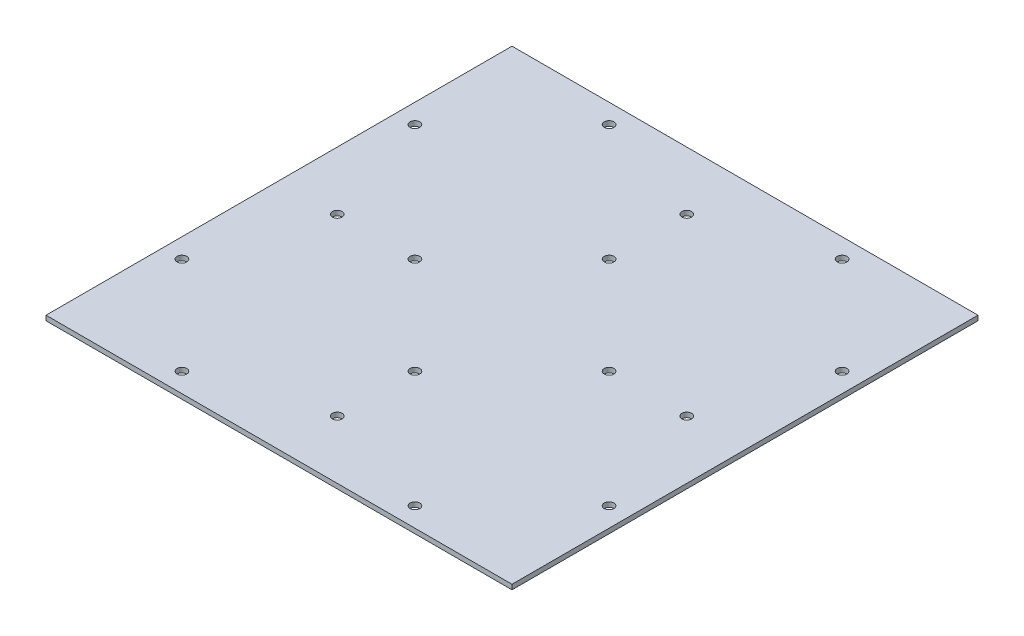
ISO-10303-21;
HEADER;
FILE_DESCRIPTION(('STEP AP214'),'2;1');
FILE_NAME('part.step','',(''),(''),'','','');
FILE_SCHEMA(('AUTOMOTIVE_DESIGN { 1 0 10303 214 1 1 1 1 }'));
ENDSEC;
DATA;
#1=APPLICATION_CONTEXT('core data for automotive mechanical design processes');
#2=APPLICATION_PROTOCOL_DEFINITION('international standard','automotive_design',2000,#1);
#3=PRODUCT_CONTEXT('',#1,'mechanical');
#4=PRODUCT('Part','Part','',(#3));
#5=PRODUCT_RELATED_PRODUCT_CATEGORY('part','',(#4));
#6=PRODUCT_DEFINITION_FORMATION('','',#4);
#7=PRODUCT_DEFINITION_CONTEXT('part definition',#1,'design');
#8=PRODUCT_DEFINITION('design','',#6,#7);
#9=PRODUCT_DEFINITION_SHAPE('','',#8);
#10=(LENGTH_UNIT() NAMED_UNIT(*) SI_UNIT(.MILLI.,.METRE.));
#11=(NAMED_UNIT(*) PLANE_ANGLE_UNIT() SI_UNIT($,.RADIAN.));
#12=(NAMED_UNIT(*) SI_UNIT($,.STERADIAN.) SOLID_ANGLE_UNIT());
#13=UNCERTAINTY_MEASURE_WITH_UNIT(LENGTH_MEASURE(1.E-05),#10,'distance_accuracy_value','');
#14=(GEOMETRIC_REPRESENTATION_CONTEXT(3) GLOBAL_UNCERTAINTY_ASSIGNED_CONTEXT((#13)) GLOBAL_UNIT_ASSIGNED_CONTEXT((#10,
#11,#12)) REPRESENTATION_CONTEXT('',''));
#15=CARTESIAN_POINT('',(0.,0.,0.));
#16=DIRECTION('',(0.,0.,1.));
#17=DIRECTION('',(1.,0.,0.));
#18=AXIS2_PLACEMENT_3D('',#15,#16,#17);
#19=CARTESIAN_POINT('',(152.4,3.175,-152.4));
#20=DIRECTION('',(-1.,0.,0.));
#21=DIRECTION('',(0.,0.,1.));
#22=AXIS2_PLACEMENT_3D('',#19,#20,#21);
#23=PLANE('',#22);
#24=DIRECTION('',(0.,0.,-1.));
#25=VECTOR('',#24,1.);
#26=CARTESIAN_POINT('',(152.4,0.,-152.4));
#27=LINE('',#26,#25);
#28=CARTESIAN_POINT('',(152.4,0.,152.4));
#29=VERTEX_POINT('',#28);
#30=CARTESIAN_POINT('',(152.4,0.,-152.4));
#31=VERTEX_POINT('',#30);
#32=EDGE_CURVE('E99',#29,#31,#27,.T.);
#33=ORIENTED_EDGE('',*,*,#32,.T.);
#34=DIRECTION('',(0.,-1.,0.));
#35=VECTOR('',#34,1.);
#36=CARTESIAN_POINT('',(152.4,3.175,-152.4));
#37=LINE('',#36,#35);
#38=CARTESIAN_POINT('',(152.4,3.175,-152.4));
#39=VERTEX_POINT('',#38);
#40=EDGE_CURVE('E11',#39,#31,#37,.T.);
#41=ORIENTED_EDGE('',*,*,#40,.F.);
#42=DIRECTION('',(0.,0.,-1.));
#43=VECTOR('',#42,1.);
#44=CARTESIAN_POINT('',(152.4,3.175,-152.4));
#45=LINE('',#44,#43);
#46=CARTESIAN_POINT('',(152.4,3.175,152.4));
#47=VERTEX_POINT('',#46);
#48=EDGE_CURVE('E87',#47,#39,#45,.T.);
#49=ORIENTED_EDGE('',*,*,#48,.F.);
#50=DIRECTION('',(0.,-1.,0.));
#51=VECTOR('',#50,1.);
#52=CARTESIAN_POINT('',(152.4,3.175,152.4));
#53=LINE('',#52,#51);
#54=EDGE_CURVE('E95',#47,#29,#53,.T.);
#55=ORIENTED_EDGE('',*,*,#54,.T.);
#56=EDGE_LOOP('',(#33,#41,#49,#55));
#57=FACE_BOUND('',#56,.T.);
#58=ADVANCED_FACE('F36',(#57),#23,.F.);
#59=CARTESIAN_POINT('',(-152.4,3.175,-152.4));
#60=DIRECTION('',(0.,0.,1.));
#61=DIRECTION('',(1.,0.,0.));
#62=AXIS2_PLACEMENT_3D('',#59,#60,#61);
#63=PLANE('',#62);
#64=DIRECTION('',(-1.,0.,0.));
#65=VECTOR('',#64,1.);
#66=CARTESIAN_POINT('',(-152.4,0.,-152.4));
#67=LINE('',#66,#65);
#68=CARTESIAN_POINT('',(-152.4,0.,-152.4));
#69=VERTEX_POINT('',#68);
#70=EDGE_CURVE('E91',#31,#69,#67,.T.);
#71=ORIENTED_EDGE('',*,*,#70,.T.);
#72=DIRECTION('',(0.,-1.,0.));
#73=VECTOR('',#72,1.);
#74=CARTESIAN_POINT('',(-152.4,3.175,-152.4));
#75=LINE('',#74,#73);
#76=CARTESIAN_POINT('',(-152.4,3.175,-152.4));
#77=VERTEX_POINT('',#76);
#78=EDGE_CURVE('E44',#77,#69,#75,.T.);
#79=ORIENTED_EDGE('',*,*,#78,.F.);
#80=DIRECTION('',(-1.,0.,0.));
#81=VECTOR('',#80,1.);
#82=CARTESIAN_POINT('',(-152.4,3.175,-152.4));
#83=LINE('',#82,#81);
#84=EDGE_CURVE('E82',#39,#77,#83,.T.);
#85=ORIENTED_EDGE('',*,*,#84,.F.);
#86=ORIENTED_EDGE('',*,*,#40,.T.);
#87=EDGE_LOOP('',(#71,#79,#85,#86));
#88=FACE_BOUND('',#87,.T.);
#89=ADVANCED_FACE('F90',(#88),#63,.F.);
#90=CARTESIAN_POINT('',(-152.4,3.175,-152.4));
#91=DIRECTION('',(1.,0.,0.));
#92=DIRECTION('',(0.,0.,-1.));
#93=AXIS2_PLACEMENT_3D('',#90,#91,#92);
#94=PLANE('',#93);
#95=DIRECTION('',(0.,0.,1.));
#96=VECTOR('',#95,1.);
#97=CARTESIAN_POINT('',(-152.4,0.,-152.4));
#98=LINE('',#97,#96);
#99=CARTESIAN_POINT('',(-152.4,0.,152.4));
#100=VERTEX_POINT('',#99);
#101=EDGE_CURVE('E69',#69,#100,#98,.T.);
#102=ORIENTED_EDGE('',*,*,#101,.T.);
#103=DIRECTION('',(0.,-1.,0.));
#104=VECTOR('',#103,1.);
#105=CARTESIAN_POINT('',(-152.4,3.175,152.4));
#106=LINE('',#105,#104);
#107=CARTESIAN_POINT('',(-152.4,3.175,152.4));
#108=VERTEX_POINT('',#107);
#109=EDGE_CURVE('E92',#108,#100,#106,.T.);
#110=ORIENTED_EDGE('',*,*,#109,.F.);
#111=DIRECTION('',(0.,0.,1.));
#112=VECTOR('',#111,1.);
#113=CARTESIAN_POINT('',(-152.4,3.175,-152.4));
#114=LINE('',#113,#112);
#115=EDGE_CURVE('E85',#77,#108,#114,.T.);
#116=ORIENTED_EDGE('',*,*,#115,.F.);
#117=ORIENTED_EDGE('',*,*,#78,.T.);
#118=EDGE_LOOP('',(#102,#110,#116,#117));
#119=FACE_BOUND('',#118,.T.);
#120=ADVANCED_FACE('F93',(#119),#94,.F.);
#121=CARTESIAN_POINT('',(-152.4,3.175,152.4));
#122=DIRECTION('',(0.,0.,-1.));
#123=DIRECTION('',(-1.,0.,0.));
#124=AXIS2_PLACEMENT_3D('',#121,#122,#123);
#125=PLANE('',#124);
#126=DIRECTION('',(1.,0.,0.));
#127=VECTOR('',#126,1.);
#128=CARTESIAN_POINT('',(-152.4,0.,152.4));
#129=LINE('',#128,#127);
#130=EDGE_CURVE('E75',#100,#29,#129,.T.);
#131=ORIENTED_EDGE('',*,*,#130,.T.);
#132=ORIENTED_EDGE('',*,*,#54,.F.);
#133=DIRECTION('',(1.,0.,0.));
#134=VECTOR('',#133,1.);
#135=CARTESIAN_POINT('',(-152.4,3.175,152.4));
#136=LINE('',#135,#134);
#137=EDGE_CURVE('E52',#108,#47,#136,.T.);
#138=ORIENTED_EDGE('',*,*,#137,.F.);
#139=ORIENTED_EDGE('',*,*,#109,.T.);
#140=EDGE_LOOP('',(#131,#132,#138,#139));
#141=FACE_BOUND('',#140,.T.);
#142=ADVANCED_FACE('F107',(#141),#125,.F.);
#143=CARTESIAN_POINT('',(0.,3.175,0.));
#144=DIRECTION('',(0.,1.,0.));
#145=DIRECTION('',(0.,0.,1.));
#146=AXIS2_PLACEMENT_3D('',#143,#144,#145);
#147=PLANE('',#146);
#148=CARTESIAN_POINT('',(139.699999999999,3.175,-76.2000000000015));
#149=DIRECTION('',(0.,1.,0.));
#150=DIRECTION('',(-1.,0.,0.));
#151=AXIS2_PLACEMENT_3D('',#148,#149,#150);
#152=CIRCLE('',#151,3.175);
#153=CARTESIAN_POINT('',(136.524999999999,3.175,-76.2000000000014));
#154=VERTEX_POINT('',#153);
#155=EDGE_CURVE('E195',#154,#154,#152,.T.);
#156=ORIENTED_EDGE('',*,*,#155,.F.);
#157=EDGE_LOOP('',(#156));
#158=FACE_BOUND('',#157,.T.);
#159=CARTESIAN_POINT('',(-76.2,3.175,139.7));
#160=DIRECTION('',(0.,1.,0.));
#161=DIRECTION('',(0.,0.,-1.));
#162=AXIS2_PLACEMENT_3D('',#159,#160,#161);
#163=CIRCLE('',#162,3.17499999999997);
#164=CARTESIAN_POINT('',(-76.2,3.175,136.525));
#165=VERTEX_POINT('',#164);
#166=EDGE_CURVE('E194',#165,#165,#163,.T.);
#167=ORIENTED_EDGE('',*,*,#166,.F.);
#168=EDGE_LOOP('',(#167));
#169=FACE_BOUND('',#168,.T.);
#170=CARTESIAN_POINT('',(76.2,3.175,139.7));
#171=DIRECTION('',(0.,1.,0.));
#172=DIRECTION('',(0.,0.,-1.));
#173=AXIS2_PLACEMENT_3D('',#170,#171,#172);
#174=CIRCLE('',#173,3.175);
#175=CARTESIAN_POINT('',(76.2,3.175,136.525));
#176=VERTEX_POINT('',#175);
#177=EDGE_CURVE('E183',#176,#176,#174,.T.);
#178=ORIENTED_EDGE('',*,*,#177,.F.);
#179=EDGE_LOOP('',(#178));
#180=FACE_BOUND('',#179,.T.);
#181=CARTESIAN_POINT('',(-139.7,3.175,-76.1999999999995));
#182=DIRECTION('',(0.,1.,0.));
#183=DIRECTION('',(1.,0.,0.));
#184=AXIS2_PLACEMENT_3D('',#181,#182,#183);
#185=CIRCLE('',#184,3.17499999999997);
#186=CARTESIAN_POINT('',(-136.525,3.175,-76.1999999999995));
#187=VERTEX_POINT('',#186);
#188=EDGE_CURVE('E182',#187,#187,#185,.T.);
#189=ORIENTED_EDGE('',*,*,#188,.F.);
#190=EDGE_LOOP('',(#189));
#191=FACE_BOUND('',#190,.T.);
#192=CARTESIAN_POINT('',(139.700000000001,3.175,76.1999999999986));
#193=DIRECTION('',(0.,1.,0.));
#194=DIRECTION('',(-1.,0.,0.));
#195=AXIS2_PLACEMENT_3D('',#192,#193,#194);
#196=CIRCLE('',#195,3.17499999999997);
#197=CARTESIAN_POINT('',(136.525000000001,3.175,76.1999999999986));
#198=VERTEX_POINT('',#197);
#199=EDGE_CURVE('E205',#198,#198,#196,.T.);
#200=ORIENTED_EDGE('',*,*,#199,.F.);
#201=EDGE_LOOP('',(#200));
#202=FACE_BOUND('',#201,.T.);
#203=CARTESIAN_POINT('',(-139.7,3.175,76.2000000000005));
#204=DIRECTION('',(0.,1.,0.));
#205=DIRECTION('',(1.,0.,0.));
#206=AXIS2_PLACEMENT_3D('',#203,#204,#205);
#207=CIRCLE('',#206,3.175);
#208=CARTESIAN_POINT('',(-136.525,3.175,76.2000000000005));
#209=VERTEX_POINT('',#208);
#210=EDGE_CURVE('E175',#209,#209,#207,.T.);
#211=ORIENTED_EDGE('',*,*,#210,.F.);
#212=EDGE_LOOP('',(#211));
#213=FACE_BOUND('',#212,.T.);
#214=CARTESIAN_POINT('',(-76.2,3.175,-139.7));
#215=DIRECTION('',(0.,1.,0.));
#216=DIRECTION('',(0.,0.,1.));
#217=AXIS2_PLACEMENT_3D('',#214,#215,#216);
#218=CIRCLE('',#217,3.175);
#219=CARTESIAN_POINT('',(-76.2,3.175,-136.525));
#220=VERTEX_POINT('',#219);
#221=EDGE_CURVE('E164',#220,#220,#218,.T.);
#222=ORIENTED_EDGE('',*,*,#221,.F.);
#223=EDGE_LOOP('',(#222));
#224=FACE_BOUND('',#223,.T.);
#225=CARTESIAN_POINT('',(76.2,3.175,-139.7));
#226=DIRECTION('',(0.,1.,0.));
#227=DIRECTION('',(0.,0.,1.));
#228=AXIS2_PLACEMENT_3D('',#225,#226,#227);
#229=CIRCLE('',#228,3.17499999999997);
#230=CARTESIAN_POINT('',(76.2,3.175,-136.525));
#231=VERTEX_POINT('',#230);
#232=EDGE_CURVE('E165',#231,#231,#229,.T.);
#233=ORIENTED_EDGE('',*,*,#232,.F.);
#234=EDGE_LOOP('',(#233));
#235=FACE_BOUND('',#234,.T.);
#236=CARTESIAN_POINT('',(-114.3,3.175,3.9907631702977E-13));
#237=DIRECTION('',(0.,1.,0.));
#238=DIRECTION('',(1.,0.,0.));
#239=AXIS2_PLACEMENT_3D('',#236,#237,#238);
#240=CIRCLE('',#239,3.175);
#241=CARTESIAN_POINT('',(-111.125,3.175,3.87990863778943E-13));
#242=VERTEX_POINT('',#241);
#243=EDGE_CURVE('E136',#242,#242,#240,.T.);
#244=ORIENTED_EDGE('',*,*,#243,.F.);
#245=EDGE_LOOP('',(#244));
#246=FACE_BOUND('',#245,.T.);
#247=CARTESIAN_POINT('',(63.5,3.175,-6.65127195049617E-13));
#248=DIRECTION('',(0.,1.,0.));
#249=DIRECTION('',(-1.,0.,0.));
#250=AXIS2_PLACEMENT_3D('',#247,#248,#249);
#251=CIRCLE('',#250,3.175);
#252=CARTESIAN_POINT('',(60.325,3.175,-6.31870835297136E-13));
#253=VERTEX_POINT('',#252);
#254=EDGE_CURVE('E153',#253,#253,#251,.T.);
#255=ORIENTED_EDGE('',*,*,#254,.F.);
#256=EDGE_LOOP('',(#255));
#257=FACE_BOUND('',#256,.T.);
#258=CARTESIAN_POINT('',(-63.5,3.175,2.21709065016539E-13));
#259=DIRECTION('',(0.,1.,0.));
#260=DIRECTION('',(1.,0.,0.));
#261=AXIS2_PLACEMENT_3D('',#258,#259,#260);
#262=CIRCLE('',#261,3.175);
#263=CARTESIAN_POINT('',(-60.325,3.175,2.10623611765712E-13));
#264=VERTEX_POINT('',#263);
#265=EDGE_CURVE('E128',#264,#264,#262,.T.);
#266=ORIENTED_EDGE('',*,*,#265,.F.);
#267=EDGE_LOOP('',(#266));
#268=FACE_BOUND('',#267,.T.);
#269=CARTESIAN_POINT('',(0.,3.175,114.3));
#270=DIRECTION('',(0.,1.,0.));
#271=DIRECTION('',(0.,0.,-1.));
#272=AXIS2_PLACEMENT_3D('',#269,#270,#271);
#273=CIRCLE('',#272,3.175);
#274=CARTESIAN_POINT('',(0.,3.175,111.125));
#275=VERTEX_POINT('',#274);
#276=EDGE_CURVE('E129',#275,#275,#273,.T.);
#277=ORIENTED_EDGE('',*,*,#276,.F.);
#278=EDGE_LOOP('',(#277));
#279=FACE_BOUND('',#278,.T.);
#280=CARTESIAN_POINT('',(0.,3.175,63.5));
#281=DIRECTION('',(0.,1.,0.));
#282=DIRECTION('',(0.,0.,-1.));
#283=AXIS2_PLACEMENT_3D('',#280,#281,#282);
#284=CIRCLE('',#283,3.175);
#285=CARTESIAN_POINT('',(0.,3.175,60.325));
#286=VERTEX_POINT('',#285);
#287=EDGE_CURVE('E142',#286,#286,#284,.T.);
#288=ORIENTED_EDGE('',*,*,#287,.F.);
#289=EDGE_LOOP('',(#288));
#290=FACE_BOUND('',#289,.T.);
#291=CARTESIAN_POINT('',(114.3,3.175,-1.19722895108931E-12));
#292=DIRECTION('',(0.,1.,0.));
#293=DIRECTION('',(-1.,0.,0.));
#294=AXIS2_PLACEMENT_3D('',#291,#292,#293);
#295=CIRCLE('',#294,3.175);
#296=CARTESIAN_POINT('',(111.125,3.175,-1.16397259133683E-12));
#297=VERTEX_POINT('',#296);
#298=EDGE_CURVE('E143',#297,#297,#295,.T.);
#299=ORIENTED_EDGE('',*,*,#298,.F.);
#300=EDGE_LOOP('',(#299));
#301=FACE_BOUND('',#300,.T.);
#302=CARTESIAN_POINT('',(0.,3.175,-114.3));
#303=DIRECTION('',(0.,1.,0.));
#304=DIRECTION('',(0.,0.,1.));
#305=AXIS2_PLACEMENT_3D('',#302,#303,#304);
#306=CIRCLE('',#305,3.175);
#307=CARTESIAN_POINT('',(0.,3.175,-111.125));
#308=VERTEX_POINT('',#307);
#309=EDGE_CURVE('E116',#308,#308,#306,.T.);
#310=ORIENTED_EDGE('',*,*,#309,.F.);
#311=EDGE_LOOP('',(#310));
#312=FACE_BOUND('',#311,.T.);
#313=CARTESIAN_POINT('',(0.,3.175,-63.5));
#314=DIRECTION('',(0.,1.,0.));
#315=DIRECTION('',(0.,0.,1.));
#316=AXIS2_PLACEMENT_3D('',#313,#314,#315);
#317=CIRCLE('',#316,3.175);
#318=CARTESIAN_POINT('',(0.,3.175,-60.325));
#319=VERTEX_POINT('',#318);
#320=EDGE_CURVE('E117',#319,#319,#317,.T.);
#321=ORIENTED_EDGE('',*,*,#320,.F.);
#322=EDGE_LOOP('',(#321));
#323=FACE_BOUND('',#322,.T.);
#324=ORIENTED_EDGE('',*,*,#48,.T.);
#325=ORIENTED_EDGE('',*,*,#84,.T.);
#326=ORIENTED_EDGE('',*,*,#115,.T.);
#327=ORIENTED_EDGE('',*,*,#137,.T.);
#328=EDGE_LOOP('',(#324,#325,#326,#327));
#329=FACE_BOUND('',#328,.T.);
#330=ADVANCED_FACE('F83',(#158,#169,#180,#191,#202,#213,#224,#235,#246,#257,#268,#279,#290,#301,
#312,#323,#329),#147,.T.);
#331=CARTESIAN_POINT('',(0.,0.,0.));
#332=DIRECTION('',(0.,1.,0.));
#333=DIRECTION('',(0.,0.,1.));
#334=AXIS2_PLACEMENT_3D('',#331,#332,#333);
#335=PLANE('',#334);
#336=CARTESIAN_POINT('',(139.699999999999,0.,-76.2000000000015));
#337=DIRECTION('',(0.,1.,0.));
#338=DIRECTION('',(0.,0.,1.));
#339=AXIS2_PLACEMENT_3D('',#336,#337,#338);
#340=CIRCLE('',#339,3.175);
#341=CARTESIAN_POINT('',(139.699999999999,0.,-73.0250000000015));
#342=VERTEX_POINT('',#341);
#343=EDGE_CURVE('E191',#342,#342,#340,.F.);
#344=ORIENTED_EDGE('',*,*,#343,.F.);
#345=EDGE_LOOP('',(#344));
#346=FACE_BOUND('',#345,.T.);
#347=CARTESIAN_POINT('',(-76.2,0.,139.7));
#348=DIRECTION('',(0.,1.,0.));
#349=DIRECTION('',(0.,0.,1.));
#350=AXIS2_PLACEMENT_3D('',#347,#348,#349);
#351=CIRCLE('',#350,3.17499999999997);
#352=CARTESIAN_POINT('',(-76.2,0.,142.875));
#353=VERTEX_POINT('',#352);
#354=EDGE_CURVE('E186',#353,#353,#351,.F.);
#355=ORIENTED_EDGE('',*,*,#354,.F.);
#356=EDGE_LOOP('',(#355));
#357=FACE_BOUND('',#356,.T.);
#358=CARTESIAN_POINT('',(76.2,0.,139.7));
#359=DIRECTION('',(0.,1.,0.));
#360=DIRECTION('',(0.,0.,1.));
#361=AXIS2_PLACEMENT_3D('',#358,#359,#360);
#362=CIRCLE('',#361,3.175);
#363=CARTESIAN_POINT('',(76.2,0.,142.875));
#364=VERTEX_POINT('',#363);
#365=EDGE_CURVE('E179',#364,#364,#362,.F.);
#366=ORIENTED_EDGE('',*,*,#365,.F.);
#367=EDGE_LOOP('',(#366));
#368=FACE_BOUND('',#367,.T.);
#369=CARTESIAN_POINT('',(-139.7,0.,-76.1999999999995));
#370=DIRECTION('',(0.,1.,0.));
#371=DIRECTION('',(0.,0.,1.));
#372=AXIS2_PLACEMENT_3D('',#369,#370,#371);
#373=CIRCLE('',#372,3.17499999999997);
#374=CARTESIAN_POINT('',(-139.7,0.,-73.0249999999996));
#375=VERTEX_POINT('',#374);
#376=EDGE_CURVE('E178',#375,#375,#373,.F.);
#377=ORIENTED_EDGE('',*,*,#376,.F.);
#378=EDGE_LOOP('',(#377));
#379=FACE_BOUND('',#378,.T.);
#380=CARTESIAN_POINT('',(139.700000000001,0.,76.1999999999986));
#381=DIRECTION('',(0.,1.,0.));
#382=DIRECTION('',(0.,0.,1.));
#383=AXIS2_PLACEMENT_3D('',#380,#381,#382);
#384=CIRCLE('',#383,3.17499999999997);
#385=CARTESIAN_POINT('',(139.700000000001,0.,79.3749999999985));
#386=VERTEX_POINT('',#385);
#387=EDGE_CURVE('E198',#386,#386,#384,.F.);
#388=ORIENTED_EDGE('',*,*,#387,.F.);
#389=EDGE_LOOP('',(#388));
#390=FACE_BOUND('',#389,.T.);
#391=CARTESIAN_POINT('',(-139.7,0.,76.2000000000005));
#392=DIRECTION('',(0.,1.,0.));
#393=DIRECTION('',(0.,0.,1.));
#394=AXIS2_PLACEMENT_3D('',#391,#392,#393);
#395=CIRCLE('',#394,3.175);
#396=CARTESIAN_POINT('',(-139.7,0.,79.3750000000005));
#397=VERTEX_POINT('',#396);
#398=EDGE_CURVE('E168',#397,#397,#395,.F.);
#399=ORIENTED_EDGE('',*,*,#398,.F.);
#400=EDGE_LOOP('',(#399));
#401=FACE_BOUND('',#400,.T.);
#402=CARTESIAN_POINT('',(-76.2,0.,-139.7));
#403=DIRECTION('',(0.,1.,0.));
#404=DIRECTION('',(0.,0.,1.));
#405=AXIS2_PLACEMENT_3D('',#402,#403,#404);
#406=CIRCLE('',#405,3.175);
#407=CARTESIAN_POINT('',(-76.2,0.,-136.525));
#408=VERTEX_POINT('',#407);
#409=EDGE_CURVE('E156',#408,#408,#406,.F.);
#410=ORIENTED_EDGE('',*,*,#409,.F.);
#411=EDGE_LOOP('',(#410));
#412=FACE_BOUND('',#411,.T.);
#413=CARTESIAN_POINT('',(76.2,0.,-139.7));
#414=DIRECTION('',(0.,1.,0.));
#415=DIRECTION('',(0.,0.,1.));
#416=AXIS2_PLACEMENT_3D('',#413,#414,#415);
#417=CIRCLE('',#416,3.17499999999997);
#418=CARTESIAN_POINT('',(76.2,0.,-136.525));
#419=VERTEX_POINT('',#418);
#420=EDGE_CURVE('E161',#419,#419,#417,.F.);
#421=ORIENTED_EDGE('',*,*,#420,.F.);
#422=EDGE_LOOP('',(#421));
#423=FACE_BOUND('',#422,.T.);
#424=CARTESIAN_POINT('',(-114.3,0.,3.9907631702977E-13));
#425=DIRECTION('',(0.,1.,0.));
#426=DIRECTION('',(0.,0.,1.));
#427=AXIS2_PLACEMENT_3D('',#424,#425,#426);
#428=CIRCLE('',#427,3.175);
#429=CARTESIAN_POINT('',(-114.3,0.,3.1750000000004));
#430=VERTEX_POINT('',#429);
#431=EDGE_CURVE('E120',#430,#430,#428,.F.);
#432=ORIENTED_EDGE('',*,*,#431,.F.);
#433=EDGE_LOOP('',(#432));
#434=FACE_BOUND('',#433,.T.);
#435=CARTESIAN_POINT('',(63.5,0.,-6.65127195049617E-13));
#436=DIRECTION('',(0.,1.,0.));
#437=DIRECTION('',(0.,0.,1.));
#438=AXIS2_PLACEMENT_3D('',#435,#436,#437);
#439=CIRCLE('',#438,3.175);
#440=CARTESIAN_POINT('',(63.5,0.,3.17499999999933));
#441=VERTEX_POINT('',#440);
#442=EDGE_CURVE('E146',#441,#441,#439,.F.);
#443=ORIENTED_EDGE('',*,*,#442,.F.);
#444=EDGE_LOOP('',(#443));
#445=FACE_BOUND('',#444,.T.);
#446=CARTESIAN_POINT('',(-63.5,0.,2.21709065016539E-13));
#447=DIRECTION('',(0.,1.,0.));
#448=DIRECTION('',(0.,0.,1.));
#449=AXIS2_PLACEMENT_3D('',#446,#447,#448);
#450=CIRCLE('',#449,3.175);
#451=CARTESIAN_POINT('',(-63.5,0.,3.17500000000022));
#452=VERTEX_POINT('',#451);
#453=EDGE_CURVE('E133',#452,#452,#450,.F.);
#454=ORIENTED_EDGE('',*,*,#453,.F.);
#455=EDGE_LOOP('',(#454));
#456=FACE_BOUND('',#455,.T.);
#457=CARTESIAN_POINT('',(0.,0.,114.3));
#458=DIRECTION('',(0.,1.,0.));
#459=DIRECTION('',(0.,0.,1.));
#460=AXIS2_PLACEMENT_3D('',#457,#458,#459);
#461=CIRCLE('',#460,3.175);
#462=CARTESIAN_POINT('',(0.,0.,117.475));
#463=VERTEX_POINT('',#462);
#464=EDGE_CURVE('E125',#463,#463,#461,.F.);
#465=ORIENTED_EDGE('',*,*,#464,.F.);
#466=EDGE_LOOP('',(#465));
#467=FACE_BOUND('',#466,.T.);
#468=CARTESIAN_POINT('',(0.,0.,63.5));
#469=DIRECTION('',(0.,1.,0.));
#470=DIRECTION('',(0.,0.,1.));
#471=AXIS2_PLACEMENT_3D('',#468,#469,#470);
#472=CIRCLE('',#471,3.175);
#473=CARTESIAN_POINT('',(0.,0.,66.675));
#474=VERTEX_POINT('',#473);
#475=EDGE_CURVE('E132',#474,#474,#472,.F.);
#476=ORIENTED_EDGE('',*,*,#475,.F.);
#477=EDGE_LOOP('',(#476));
#478=FACE_BOUND('',#477,.T.);
#479=CARTESIAN_POINT('',(114.3,0.,-1.19722895108931E-12));
#480=DIRECTION('',(0.,1.,0.));
#481=DIRECTION('',(0.,0.,1.));
#482=AXIS2_PLACEMENT_3D('',#479,#480,#481);
#483=CIRCLE('',#482,3.175);
#484=CARTESIAN_POINT('',(114.3,0.,3.1749999999988));
#485=VERTEX_POINT('',#484);
#486=EDGE_CURVE('E139',#485,#485,#483,.F.);
#487=ORIENTED_EDGE('',*,*,#486,.F.);
#488=EDGE_LOOP('',(#487));
#489=FACE_BOUND('',#488,.T.);
#490=CARTESIAN_POINT('',(0.,0.,-114.3));
#491=DIRECTION('',(0.,1.,0.));
#492=DIRECTION('',(0.,0.,1.));
#493=AXIS2_PLACEMENT_3D('',#490,#491,#492);
#494=CIRCLE('',#493,3.175);
#495=CARTESIAN_POINT('',(0.,0.,-111.125));
#496=VERTEX_POINT('',#495);
#497=EDGE_CURVE('E102',#496,#496,#494,.F.);
#498=ORIENTED_EDGE('',*,*,#497,.F.);
#499=EDGE_LOOP('',(#498));
#500=FACE_BOUND('',#499,.T.);
#501=CARTESIAN_POINT('',(0.,0.,-63.5));
#502=DIRECTION('',(0.,1.,0.));
#503=DIRECTION('',(0.,0.,1.));
#504=AXIS2_PLACEMENT_3D('',#501,#502,#503);
#505=CIRCLE('',#504,3.175);
#506=CARTESIAN_POINT('',(0.,0.,-60.325));
#507=VERTEX_POINT('',#506);
#508=EDGE_CURVE('E113',#507,#507,#505,.F.);
#509=ORIENTED_EDGE('',*,*,#508,.F.);
#510=EDGE_LOOP('',(#509));
#511=FACE_BOUND('',#510,.T.);
#512=ORIENTED_EDGE('',*,*,#32,.F.);
#513=ORIENTED_EDGE('',*,*,#130,.F.);
#514=ORIENTED_EDGE('',*,*,#101,.F.);
#515=ORIENTED_EDGE('',*,*,#70,.F.);
#516=EDGE_LOOP('',(#512,#513,#514,#515));
#517=FACE_BOUND('',#516,.T.);
#518=ADVANCED_FACE('F110',(#346,#357,#368,#379,#390,#401,#412,#423,#434,#445,#456,#467,#478,
#489,#500,#511,#517),#335,.F.);
#519=CARTESIAN_POINT('',(0.,-0.00100000000000013,-63.5));
#520=DIRECTION('',(0.,1.,0.));
#521=DIRECTION('',(0.,0.,1.));
#522=AXIS2_PLACEMENT_3D('',#519,#520,#521);
#523=CYLINDRICAL_SURFACE('',#522,3.175);
#524=ORIENTED_EDGE('',*,*,#320,.T.);
#525=EDGE_LOOP('',(#524));
#526=FACE_BOUND('',#525,.T.);
#527=ORIENTED_EDGE('',*,*,#508,.T.);
#528=EDGE_LOOP('',(#527));
#529=FACE_BOUND('',#528,.T.);
#530=ADVANCED_FACE('F238',(#526,#529),#523,.F.);
#531=CARTESIAN_POINT('',(0.,-0.00100000000000013,-114.3));
#532=DIRECTION('',(0.,1.,0.));
#533=DIRECTION('',(0.,0.,1.));
#534=AXIS2_PLACEMENT_3D('',#531,#532,#533);
#535=CYLINDRICAL_SURFACE('',#534,3.175);
#536=ORIENTED_EDGE('',*,*,#309,.T.);
#537=EDGE_LOOP('',(#536));
#538=FACE_BOUND('',#537,.T.);
#539=ORIENTED_EDGE('',*,*,#497,.T.);
#540=EDGE_LOOP('',(#539));
#541=FACE_BOUND('',#540,.T.);
#542=ADVANCED_FACE('F241',(#538,#541),#535,.F.);
#543=CARTESIAN_POINT('',(114.3,-0.00100000000000013,-1.19722895108931E-12));
#544=DIRECTION('',(0.,1.,0.));
#545=DIRECTION('',(0.,0.,1.));
#546=AXIS2_PLACEMENT_3D('',#543,#544,#545);
#547=CYLINDRICAL_SURFACE('',#546,3.175);
#548=ORIENTED_EDGE('',*,*,#298,.T.);
#549=EDGE_LOOP('',(#548));
#550=FACE_BOUND('',#549,.T.);
#551=ORIENTED_EDGE('',*,*,#486,.T.);
#552=EDGE_LOOP('',(#551));
#553=FACE_BOUND('',#552,.T.);
#554=ADVANCED_FACE('F365',(#550,#553),#547,.F.);
#555=CARTESIAN_POINT('',(0.,-0.00100000000000013,63.5));
#556=DIRECTION('',(0.,1.,0.));
#557=DIRECTION('',(0.,0.,1.));
#558=AXIS2_PLACEMENT_3D('',#555,#556,#557);
#559=CYLINDRICAL_SURFACE('',#558,3.175);
#560=ORIENTED_EDGE('',*,*,#287,.T.);
#561=EDGE_LOOP('',(#560));
#562=FACE_BOUND('',#561,.T.);
#563=ORIENTED_EDGE('',*,*,#475,.T.);
#564=EDGE_LOOP('',(#563));
#565=FACE_BOUND('',#564,.T.);
#566=ADVANCED_FACE('F361',(#562,#565),#559,.F.);
#567=CARTESIAN_POINT('',(0.,-0.00100000000000013,114.3));
#568=DIRECTION('',(0.,1.,0.));
#569=DIRECTION('',(0.,0.,1.));
#570=AXIS2_PLACEMENT_3D('',#567,#568,#569);
#571=CYLINDRICAL_SURFACE('',#570,3.175);
#572=ORIENTED_EDGE('',*,*,#276,.T.);
#573=EDGE_LOOP('',(#572));
#574=FACE_BOUND('',#573,.T.);
#575=ORIENTED_EDGE('',*,*,#464,.T.);
#576=EDGE_LOOP('',(#575));
#577=FACE_BOUND('',#576,.T.);
#578=ADVANCED_FACE('F364',(#574,#577),#571,.F.);
#579=CARTESIAN_POINT('',(-63.5,-0.00100000000000013,2.21709065016539E-13));
#580=DIRECTION('',(0.,1.,0.));
#581=DIRECTION('',(0.,0.,1.));
#582=AXIS2_PLACEMENT_3D('',#579,#580,#581);
#583=CYLINDRICAL_SURFACE('',#582,3.175);
#584=ORIENTED_EDGE('',*,*,#265,.T.);
#585=EDGE_LOOP('',(#584));
#586=FACE_BOUND('',#585,.T.);
#587=ORIENTED_EDGE('',*,*,#453,.T.);
#588=EDGE_LOOP('',(#587));
#589=FACE_BOUND('',#588,.T.);
#590=ADVANCED_FACE('F359',(#586,#589),#583,.F.);
#591=CARTESIAN_POINT('',(63.5,-0.00100000000000013,-6.65127195049617E-13));
#592=DIRECTION('',(0.,1.,0.));
#593=DIRECTION('',(0.,0.,1.));
#594=AXIS2_PLACEMENT_3D('',#591,#592,#593);
#595=CYLINDRICAL_SURFACE('',#594,3.175);
#596=ORIENTED_EDGE('',*,*,#254,.T.);
#597=EDGE_LOOP('',(#596));
#598=FACE_BOUND('',#597,.T.);
#599=ORIENTED_EDGE('',*,*,#442,.T.);
#600=EDGE_LOOP('',(#599));
#601=FACE_BOUND('',#600,.T.);
#602=ADVANCED_FACE('F355',(#598,#601),#595,.F.);
#603=CARTESIAN_POINT('',(-114.3,-0.00100000000000013,3.9907631702977E-13));
#604=DIRECTION('',(0.,1.,0.));
#605=DIRECTION('',(0.,0.,1.));
#606=AXIS2_PLACEMENT_3D('',#603,#604,#605);
#607=CYLINDRICAL_SURFACE('',#606,3.175);
#608=ORIENTED_EDGE('',*,*,#243,.T.);
#609=EDGE_LOOP('',(#608));
#610=FACE_BOUND('',#609,.T.);
#611=ORIENTED_EDGE('',*,*,#431,.T.);
#612=EDGE_LOOP('',(#611));
#613=FACE_BOUND('',#612,.T.);
#614=ADVANCED_FACE('F351',(#610,#613),#607,.F.);
#615=CARTESIAN_POINT('',(76.2,-0.00100000000000013,-139.7));
#616=DIRECTION('',(0.,1.,0.));
#617=DIRECTION('',(0.,0.,1.));
#618=AXIS2_PLACEMENT_3D('',#615,#616,#617);
#619=CYLINDRICAL_SURFACE('',#618,3.17499999999997);
#620=ORIENTED_EDGE('',*,*,#232,.T.);
#621=EDGE_LOOP('',(#620));
#622=FACE_BOUND('',#621,.T.);
#623=ORIENTED_EDGE('',*,*,#420,.T.);
#624=EDGE_LOOP('',(#623));
#625=FACE_BOUND('',#624,.T.);
#626=ADVANCED_FACE('F347',(#622,#625),#619,.F.);
#627=CARTESIAN_POINT('',(-76.2,-0.00100000000000013,-139.7));
#628=DIRECTION('',(0.,1.,0.));
#629=DIRECTION('',(0.,0.,1.));
#630=AXIS2_PLACEMENT_3D('',#627,#628,#629);
#631=CYLINDRICAL_SURFACE('',#630,3.175);
#632=ORIENTED_EDGE('',*,*,#221,.T.);
#633=EDGE_LOOP('',(#632));
#634=FACE_BOUND('',#633,.T.);
#635=ORIENTED_EDGE('',*,*,#409,.T.);
#636=EDGE_LOOP('',(#635));
#637=FACE_BOUND('',#636,.T.);
#638=ADVANCED_FACE('F277',(#634,#637),#631,.F.);
#639=CARTESIAN_POINT('',(-139.7,-0.00100000000000013,76.2000000000005));
#640=DIRECTION('',(0.,1.,0.));
#641=DIRECTION('',(0.,0.,1.));
#642=AXIS2_PLACEMENT_3D('',#639,#640,#641);
#643=CYLINDRICAL_SURFACE('',#642,3.175);
#644=ORIENTED_EDGE('',*,*,#210,.T.);
#645=EDGE_LOOP('',(#644));
#646=FACE_BOUND('',#645,.T.);
#647=ORIENTED_EDGE('',*,*,#398,.T.);
#648=EDGE_LOOP('',(#647));
#649=FACE_BOUND('',#648,.T.);
#650=ADVANCED_FACE('F287',(#646,#649),#643,.F.);
#651=CARTESIAN_POINT('',(139.700000000001,-0.00100000000000013,76.1999999999986));
#652=DIRECTION('',(0.,1.,0.));
#653=DIRECTION('',(0.,0.,1.));
#654=AXIS2_PLACEMENT_3D('',#651,#652,#653);
#655=CYLINDRICAL_SURFACE('',#654,3.17499999999997);
#656=ORIENTED_EDGE('',*,*,#199,.T.);
#657=EDGE_LOOP('',(#656));
#658=FACE_BOUND('',#657,.T.);
#659=ORIENTED_EDGE('',*,*,#387,.T.);
#660=EDGE_LOOP('',(#659));
#661=FACE_BOUND('',#660,.T.);
#662=ADVANCED_FACE('F209',(#658,#661),#655,.F.);
#663=CARTESIAN_POINT('',(-139.7,-0.00100000000000013,-76.1999999999995));
#664=DIRECTION('',(0.,1.,0.));
#665=DIRECTION('',(0.,0.,1.));
#666=AXIS2_PLACEMENT_3D('',#663,#664,#665);
#667=CYLINDRICAL_SURFACE('',#666,3.17499999999997);
#668=ORIENTED_EDGE('',*,*,#188,.T.);
#669=EDGE_LOOP('',(#668));
#670=FACE_BOUND('',#669,.T.);
#671=ORIENTED_EDGE('',*,*,#376,.T.);
#672=EDGE_LOOP('',(#671));
#673=FACE_BOUND('',#672,.T.);
#674=ADVANCED_FACE('F301',(#670,#673),#667,.F.);
#675=CARTESIAN_POINT('',(76.2,-0.00100000000000013,139.7));
#676=DIRECTION('',(0.,1.,0.));
#677=DIRECTION('',(0.,0.,1.));
#678=AXIS2_PLACEMENT_3D('',#675,#676,#677);
#679=CYLINDRICAL_SURFACE('',#678,3.175);
#680=ORIENTED_EDGE('',*,*,#177,.T.);
#681=EDGE_LOOP('',(#680));
#682=FACE_BOUND('',#681,.T.);
#683=ORIENTED_EDGE('',*,*,#365,.T.);
#684=EDGE_LOOP('',(#683));
#685=FACE_BOUND('',#684,.T.);
#686=ADVANCED_FACE('F310',(#682,#685),#679,.F.);
#687=CARTESIAN_POINT('',(-76.2,-0.00100000000000013,139.7));
#688=DIRECTION('',(0.,1.,0.));
#689=DIRECTION('',(0.,0.,1.));
#690=AXIS2_PLACEMENT_3D('',#687,#688,#689);
#691=CYLINDRICAL_SURFACE('',#690,3.17499999999997);
#692=ORIENTED_EDGE('',*,*,#166,.T.);
#693=EDGE_LOOP('',(#692));
#694=FACE_BOUND('',#693,.T.);
#695=ORIENTED_EDGE('',*,*,#354,.T.);
#696=EDGE_LOOP('',(#695));
#697=FACE_BOUND('',#696,.T.);
#698=ADVANCED_FACE('F320',(#694,#697),#691,.F.);
#699=CARTESIAN_POINT('',(139.699999999999,-0.00100000000000013,-76.2000000000015));
#700=DIRECTION('',(0.,1.,0.));
#701=DIRECTION('',(0.,0.,1.));
#702=AXIS2_PLACEMENT_3D('',#699,#700,#701);
#703=CYLINDRICAL_SURFACE('',#702,3.175);
#704=ORIENTED_EDGE('',*,*,#155,.T.);
#705=EDGE_LOOP('',(#704));
#706=FACE_BOUND('',#705,.T.);
#707=ORIENTED_EDGE('',*,*,#343,.T.);
#708=EDGE_LOOP('',(#707));
#709=FACE_BOUND('',#708,.T.);
#710=ADVANCED_FACE('F330',(#706,#709),#703,.F.);
#711=CLOSED_SHELL('',(#58,#89,#120,#142,#330,#518,#530,#542,#554,#566,#578,#590,#602,#614,#626,
#638,#650,#662,#674,#686,#698,#710));
#712=MANIFOLD_SOLID_BREP('B2',#711);
#713=ADVANCED_BREP_SHAPE_REPRESENTATION('',(#18,#712),#14);
#714=SHAPE_DEFINITION_REPRESENTATION(#9,#713);
ENDSEC;
END-ISO-10303-21;
